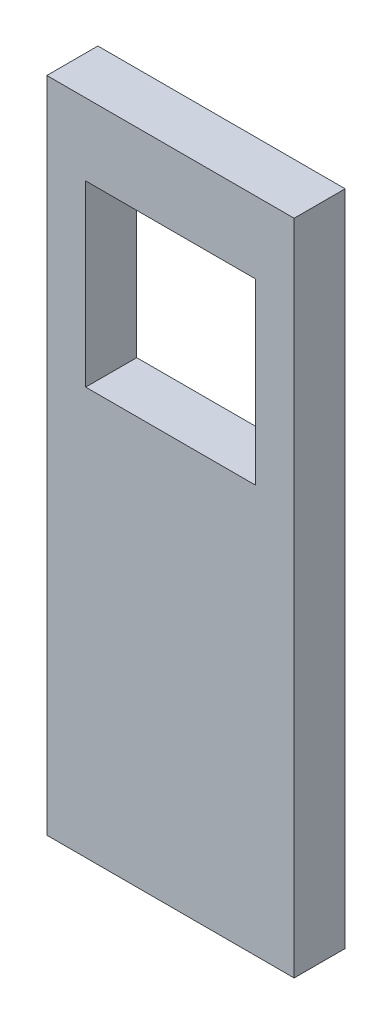
ISO-10303-21;
HEADER;
FILE_DESCRIPTION(('STEP AP214'),'2;1');
FILE_NAME('part.step','',(''),(''),'','','');
FILE_SCHEMA(('AUTOMOTIVE_DESIGN { 1 0 10303 214 1 1 1 1 }'));
ENDSEC;
DATA;
#1=APPLICATION_CONTEXT('core data for automotive mechanical design processes');
#2=APPLICATION_PROTOCOL_DEFINITION('international standard','automotive_design',2000,#1);
#3=PRODUCT_CONTEXT('',#1,'mechanical');
#4=PRODUCT('Part','Part','',(#3));
#5=PRODUCT_RELATED_PRODUCT_CATEGORY('part','',(#4));
#6=PRODUCT_DEFINITION_FORMATION('','',#4);
#7=PRODUCT_DEFINITION_CONTEXT('part definition',#1,'design');
#8=PRODUCT_DEFINITION('design','',#6,#7);
#9=PRODUCT_DEFINITION_SHAPE('','',#8);
#10=(LENGTH_UNIT() NAMED_UNIT(*) SI_UNIT(.MILLI.,.METRE.));
#11=(NAMED_UNIT(*) PLANE_ANGLE_UNIT() SI_UNIT($,.RADIAN.));
#12=(NAMED_UNIT(*) SI_UNIT($,.STERADIAN.) SOLID_ANGLE_UNIT());
#13=UNCERTAINTY_MEASURE_WITH_UNIT(LENGTH_MEASURE(1.E-05),#10,'distance_accuracy_value','');
#14=(GEOMETRIC_REPRESENTATION_CONTEXT(3) GLOBAL_UNCERTAINTY_ASSIGNED_CONTEXT((#13)) GLOBAL_UNIT_ASSIGNED_CONTEXT((#10,
#11,#12)) REPRESENTATION_CONTEXT('',''));
#15=CARTESIAN_POINT('',(0.,0.,0.));
#16=DIRECTION('',(0.,0.,1.));
#17=DIRECTION('',(1.,0.,0.));
#18=AXIS2_PLACEMENT_3D('',#15,#16,#17);
#19=CARTESIAN_POINT('',(0.,0.,2.6));
#20=DIRECTION('',(0.,0.,-1.));
#21=DIRECTION('',(-1.,0.,0.));
#22=AXIS2_PLACEMENT_3D('',#19,#20,#21);
#23=PLANE('',#22);
#24=DIRECTION('',(-1.,0.,0.));
#25=VECTOR('',#24,1.);
#26=CARTESIAN_POINT('',(-0.100000000000003,66.95,2.6));
#27=LINE('',#26,#25);
#28=CARTESIAN_POINT('',(25.1,66.95,2.6));
#29=VERTEX_POINT('',#28);
#30=CARTESIAN_POINT('',(-0.100000000000003,66.95,2.6));
#31=VERTEX_POINT('',#30);
#32=EDGE_CURVE('E134',#29,#31,#27,.T.);
#33=ORIENTED_EDGE('',*,*,#32,.T.);
#34=DIRECTION('',(0.,-1.,0.));
#35=VECTOR('',#34,1.);
#36=CARTESIAN_POINT('',(-0.100000000000003,66.95,2.6));
#37=LINE('',#36,#35);
#38=CARTESIAN_POINT('',(-0.0999999999999994,-0.0999999999999939,2.6));
#39=VERTEX_POINT('',#38);
#40=EDGE_CURVE('E137',#31,#39,#37,.T.);
#41=ORIENTED_EDGE('',*,*,#40,.T.);
#42=DIRECTION('',(1.,0.,0.));
#43=VECTOR('',#42,1.);
#44=CARTESIAN_POINT('',(25.1,-0.0999999999999925,2.6));
#45=LINE('',#44,#43);
#46=CARTESIAN_POINT('',(25.1,-0.0999999999999925,2.6));
#47=VERTEX_POINT('',#46);
#48=EDGE_CURVE('E140',#39,#47,#45,.T.);
#49=ORIENTED_EDGE('',*,*,#48,.T.);
#50=DIRECTION('',(0.,1.,0.));
#51=VECTOR('',#50,1.);
#52=CARTESIAN_POINT('',(25.1,22.3,2.6));
#53=LINE('',#52,#51);
#54=EDGE_CURVE('E142',#47,#29,#53,.T.);
#55=ORIENTED_EDGE('',*,*,#54,.T.);
#56=EDGE_LOOP('',(#33,#41,#49,#55));
#57=FACE_BOUND('',#56,.T.);
#58=DIRECTION('',(-1.,0.,0.));
#59=VECTOR('',#58,1.);
#60=CARTESIAN_POINT('',(3.86,59.625,2.6));
#61=LINE('',#60,#59);
#62=CARTESIAN_POINT('',(21.14,59.625,2.6));
#63=VERTEX_POINT('',#62);
#64=CARTESIAN_POINT('',(3.86,59.625,2.6));
#65=VERTEX_POINT('',#64);
#66=EDGE_CURVE('E98',#63,#65,#61,.T.);
#67=ORIENTED_EDGE('',*,*,#66,.F.);
#68=DIRECTION('',(0.,1.,0.));
#69=VECTOR('',#68,1.);
#70=CARTESIAN_POINT('',(21.14,59.625,2.6));
#71=LINE('',#70,#69);
#72=CARTESIAN_POINT('',(21.14,41.425,2.6));
#73=VERTEX_POINT('',#72);
#74=EDGE_CURVE('E120',#73,#63,#71,.T.);
#75=ORIENTED_EDGE('',*,*,#74,.F.);
#76=DIRECTION('',(1.,0.,0.));
#77=VECTOR('',#76,1.);
#78=CARTESIAN_POINT('',(3.86,41.425,2.6));
#79=LINE('',#78,#77);
#80=CARTESIAN_POINT('',(3.86,41.425,2.6));
#81=VERTEX_POINT('',#80);
#82=EDGE_CURVE('E118',#81,#73,#79,.T.);
#83=ORIENTED_EDGE('',*,*,#82,.F.);
#84=DIRECTION('',(0.,-1.,0.));
#85=VECTOR('',#84,1.);
#86=CARTESIAN_POINT('',(3.86,59.625,2.6));
#87=LINE('',#86,#85);
#88=EDGE_CURVE('E106',#65,#81,#87,.T.);
#89=ORIENTED_EDGE('',*,*,#88,.F.);
#90=EDGE_LOOP('',(#67,#75,#83,#89));
#91=FACE_BOUND('',#90,.T.);
#92=ADVANCED_FACE('F33',(#57,#91),#23,.F.);
#93=CARTESIAN_POINT('',(0.,0.,-2.6));
#94=DIRECTION('',(0.,0.,-1.));
#95=DIRECTION('',(-1.,0.,0.));
#96=AXIS2_PLACEMENT_3D('',#93,#94,#95);
#97=PLANE('',#96);
#98=DIRECTION('',(-1.,0.,0.));
#99=VECTOR('',#98,1.);
#100=CARTESIAN_POINT('',(-0.100000000000003,66.95,-2.6));
#101=LINE('',#100,#99);
#102=CARTESIAN_POINT('',(25.1,66.95,-2.6));
#103=VERTEX_POINT('',#102);
#104=CARTESIAN_POINT('',(-0.100000000000003,66.95,-2.6));
#105=VERTEX_POINT('',#104);
#106=EDGE_CURVE('E114',#103,#105,#101,.T.);
#107=ORIENTED_EDGE('',*,*,#106,.F.);
#108=DIRECTION('',(0.,1.,0.));
#109=VECTOR('',#108,1.);
#110=CARTESIAN_POINT('',(25.1,66.95,-2.6));
#111=LINE('',#110,#109);
#112=CARTESIAN_POINT('',(25.1,-0.0999999999999925,-2.6));
#113=VERTEX_POINT('',#112);
#114=EDGE_CURVE('E138',#113,#103,#111,.T.);
#115=ORIENTED_EDGE('',*,*,#114,.F.);
#116=DIRECTION('',(1.,0.,0.));
#117=VECTOR('',#116,1.);
#118=CARTESIAN_POINT('',(25.1,-0.0999999999999925,-2.6));
#119=LINE('',#118,#117);
#120=CARTESIAN_POINT('',(-0.0999999999999994,-0.0999999999999939,-2.6));
#121=VERTEX_POINT('',#120);
#122=EDGE_CURVE('E149',#121,#113,#119,.T.);
#123=ORIENTED_EDGE('',*,*,#122,.F.);
#124=DIRECTION('',(0.,-1.,0.));
#125=VECTOR('',#124,1.);
#126=CARTESIAN_POINT('',(-0.0999999999999985,22.3,-2.6));
#127=LINE('',#126,#125);
#128=EDGE_CURVE('E147',#105,#121,#127,.T.);
#129=ORIENTED_EDGE('',*,*,#128,.F.);
#130=EDGE_LOOP('',(#107,#115,#123,#129));
#131=FACE_BOUND('',#130,.T.);
#132=DIRECTION('',(0.,1.,0.));
#133=VECTOR('',#132,1.);
#134=CARTESIAN_POINT('',(21.14,59.625,-2.6));
#135=LINE('',#134,#133);
#136=CARTESIAN_POINT('',(21.14,41.425,-2.6));
#137=VERTEX_POINT('',#136);
#138=CARTESIAN_POINT('',(21.14,59.625,-2.6));
#139=VERTEX_POINT('',#138);
#140=EDGE_CURVE('E107',#137,#139,#135,.T.);
#141=ORIENTED_EDGE('',*,*,#140,.T.);
#142=DIRECTION('',(-1.,0.,0.));
#143=VECTOR('',#142,1.);
#144=CARTESIAN_POINT('',(3.86,59.625,-2.6));
#145=LINE('',#144,#143);
#146=CARTESIAN_POINT('',(3.86,59.625,-2.6));
#147=VERTEX_POINT('',#146);
#148=EDGE_CURVE('E56',#139,#147,#145,.T.);
#149=ORIENTED_EDGE('',*,*,#148,.T.);
#150=DIRECTION('',(0.,-1.,0.));
#151=VECTOR('',#150,1.);
#152=CARTESIAN_POINT('',(3.86,59.625,-2.6));
#153=LINE('',#152,#151);
#154=CARTESIAN_POINT('',(3.86,41.425,-2.6));
#155=VERTEX_POINT('',#154);
#156=EDGE_CURVE('E113',#147,#155,#153,.T.);
#157=ORIENTED_EDGE('',*,*,#156,.T.);
#158=DIRECTION('',(1.,0.,0.));
#159=VECTOR('',#158,1.);
#160=CARTESIAN_POINT('',(3.86,41.425,-2.6));
#161=LINE('',#160,#159);
#162=EDGE_CURVE('E126',#155,#137,#161,.T.);
#163=ORIENTED_EDGE('',*,*,#162,.T.);
#164=EDGE_LOOP('',(#141,#149,#157,#163));
#165=FACE_BOUND('',#164,.T.);
#166=ADVANCED_FACE('F167',(#131,#165),#97,.T.);
#167=CARTESIAN_POINT('',(-0.100000000000003,66.95,2.6));
#168=DIRECTION('',(0.,-1.,0.));
#169=DIRECTION('',(0.,0.,-1.));
#170=AXIS2_PLACEMENT_3D('',#167,#168,#169);
#171=PLANE('',#170);
#172=ORIENTED_EDGE('',*,*,#106,.T.);
#173=DIRECTION('',(0.,0.,-1.));
#174=VECTOR('',#173,1.);
#175=CARTESIAN_POINT('',(-0.100000000000003,66.95,2.6));
#176=LINE('',#175,#174);
#177=EDGE_CURVE('E11',#31,#105,#176,.T.);
#178=ORIENTED_EDGE('',*,*,#177,.F.);
#179=ORIENTED_EDGE('',*,*,#32,.F.);
#180=DIRECTION('',(0.,0.,-1.));
#181=VECTOR('',#180,1.);
#182=CARTESIAN_POINT('',(25.1,66.95,2.6));
#183=LINE('',#182,#181);
#184=EDGE_CURVE('E144',#29,#103,#183,.T.);
#185=ORIENTED_EDGE('',*,*,#184,.T.);
#186=EDGE_LOOP('',(#172,#178,#179,#185));
#187=FACE_BOUND('',#186,.T.);
#188=ADVANCED_FACE('F35',(#187),#171,.F.);
#189=CARTESIAN_POINT('',(-0.0999999999999985,22.3,2.6));
#190=DIRECTION('',(1.,0.,0.));
#191=DIRECTION('',(0.,1.,0.));
#192=AXIS2_PLACEMENT_3D('',#189,#190,#191);
#193=PLANE('',#192);
#194=ORIENTED_EDGE('',*,*,#128,.T.);
#195=DIRECTION('',(0.,0.,-1.));
#196=VECTOR('',#195,1.);
#197=CARTESIAN_POINT('',(-0.0999999999999994,-0.0999999999999939,2.6));
#198=LINE('',#197,#196);
#199=EDGE_CURVE('E41',#39,#121,#198,.T.);
#200=ORIENTED_EDGE('',*,*,#199,.F.);
#201=ORIENTED_EDGE('',*,*,#40,.F.);
#202=ORIENTED_EDGE('',*,*,#177,.T.);
#203=EDGE_LOOP('',(#194,#200,#201,#202));
#204=FACE_BOUND('',#203,.T.);
#205=ADVANCED_FACE('F177',(#204),#193,.F.);
#206=CARTESIAN_POINT('',(25.1,-0.0999999999999925,2.6));
#207=DIRECTION('',(0.,1.,0.));
#208=DIRECTION('',(-1.,0.,0.));
#209=AXIS2_PLACEMENT_3D('',#206,#207,#208);
#210=PLANE('',#209);
#211=ORIENTED_EDGE('',*,*,#122,.T.);
#212=DIRECTION('',(0.,0.,-1.));
#213=VECTOR('',#212,1.);
#214=CARTESIAN_POINT('',(25.1,-0.0999999999999925,2.6));
#215=LINE('',#214,#213);
#216=EDGE_CURVE('E155',#47,#113,#215,.T.);
#217=ORIENTED_EDGE('',*,*,#216,.F.);
#218=ORIENTED_EDGE('',*,*,#48,.F.);
#219=ORIENTED_EDGE('',*,*,#199,.T.);
#220=EDGE_LOOP('',(#211,#217,#218,#219));
#221=FACE_BOUND('',#220,.T.);
#222=ADVANCED_FACE('F162',(#221),#210,.F.);
#223=CARTESIAN_POINT('',(25.1,66.95,2.6));
#224=DIRECTION('',(-1.,0.,0.));
#225=DIRECTION('',(0.,-1.,0.));
#226=AXIS2_PLACEMENT_3D('',#223,#224,#225);
#227=PLANE('',#226);
#228=ORIENTED_EDGE('',*,*,#114,.T.);
#229=ORIENTED_EDGE('',*,*,#184,.F.);
#230=ORIENTED_EDGE('',*,*,#54,.F.);
#231=ORIENTED_EDGE('',*,*,#216,.T.);
#232=EDGE_LOOP('',(#228,#229,#230,#231));
#233=FACE_BOUND('',#232,.T.);
#234=ADVANCED_FACE('F171',(#233),#227,.F.);
#235=CARTESIAN_POINT('',(3.86,59.625,2.6));
#236=DIRECTION('',(0.,-1.,0.));
#237=DIRECTION('',(0.,0.,-1.));
#238=AXIS2_PLACEMENT_3D('',#235,#236,#237);
#239=PLANE('',#238);
#240=ORIENTED_EDGE('',*,*,#148,.F.);
#241=DIRECTION('',(0.,0.,-1.));
#242=VECTOR('',#241,1.);
#243=CARTESIAN_POINT('',(21.14,59.625,2.6));
#244=LINE('',#243,#242);
#245=EDGE_CURVE('E102',#63,#139,#244,.T.);
#246=ORIENTED_EDGE('',*,*,#245,.F.);
#247=ORIENTED_EDGE('',*,*,#66,.T.);
#248=DIRECTION('',(0.,0.,-1.));
#249=VECTOR('',#248,1.);
#250=CARTESIAN_POINT('',(3.86,59.625,2.6));
#251=LINE('',#250,#249);
#252=EDGE_CURVE('E101',#65,#147,#251,.T.);
#253=ORIENTED_EDGE('',*,*,#252,.T.);
#254=EDGE_LOOP('',(#240,#246,#247,#253));
#255=FACE_BOUND('',#254,.T.);
#256=ADVANCED_FACE('F100',(#255),#239,.T.);
#257=CARTESIAN_POINT('',(3.86,59.625,2.6));
#258=DIRECTION('',(1.,0.,0.));
#259=DIRECTION('',(0.,0.,-1.));
#260=AXIS2_PLACEMENT_3D('',#257,#258,#259);
#261=PLANE('',#260);
#262=ORIENTED_EDGE('',*,*,#156,.F.);
#263=ORIENTED_EDGE('',*,*,#252,.F.);
#264=ORIENTED_EDGE('',*,*,#88,.T.);
#265=DIRECTION('',(0.,0.,-1.));
#266=VECTOR('',#265,1.);
#267=CARTESIAN_POINT('',(3.86,41.425,2.6));
#268=LINE('',#267,#266);
#269=EDGE_CURVE('E115',#81,#155,#268,.T.);
#270=ORIENTED_EDGE('',*,*,#269,.T.);
#271=EDGE_LOOP('',(#262,#263,#264,#270));
#272=FACE_BOUND('',#271,.T.);
#273=ADVANCED_FACE('F110',(#272),#261,.T.);
#274=CARTESIAN_POINT('',(3.86,41.425,2.6));
#275=DIRECTION('',(0.,1.,0.));
#276=DIRECTION('',(0.,0.,1.));
#277=AXIS2_PLACEMENT_3D('',#274,#275,#276);
#278=PLANE('',#277);
#279=ORIENTED_EDGE('',*,*,#162,.F.);
#280=ORIENTED_EDGE('',*,*,#269,.F.);
#281=ORIENTED_EDGE('',*,*,#82,.T.);
#282=DIRECTION('',(0.,0.,-1.));
#283=VECTOR('',#282,1.);
#284=CARTESIAN_POINT('',(21.14,41.425,2.6));
#285=LINE('',#284,#283);
#286=EDGE_CURVE('E48',#73,#137,#285,.T.);
#287=ORIENTED_EDGE('',*,*,#286,.T.);
#288=EDGE_LOOP('',(#279,#280,#281,#287));
#289=FACE_BOUND('',#288,.T.);
#290=ADVANCED_FACE('F200',(#289),#278,.T.);
#291=CARTESIAN_POINT('',(21.14,59.625,2.6));
#292=DIRECTION('',(-1.,0.,0.));
#293=DIRECTION('',(0.,0.,1.));
#294=AXIS2_PLACEMENT_3D('',#291,#292,#293);
#295=PLANE('',#294);
#296=ORIENTED_EDGE('',*,*,#140,.F.);
#297=ORIENTED_EDGE('',*,*,#286,.F.);
#298=ORIENTED_EDGE('',*,*,#74,.T.);
#299=ORIENTED_EDGE('',*,*,#245,.T.);
#300=EDGE_LOOP('',(#296,#297,#298,#299));
#301=FACE_BOUND('',#300,.T.);
#302=ADVANCED_FACE('F204',(#301),#295,.T.);
#303=CLOSED_SHELL('',(#92,#166,#188,#205,#222,#234,#256,#273,#290,#302));
#304=MANIFOLD_SOLID_BREP('B2',#303);
#305=ADVANCED_BREP_SHAPE_REPRESENTATION('',(#18,#304),#14);
#306=SHAPE_DEFINITION_REPRESENTATION(#9,#305);
ENDSEC;
END-ISO-10303-21;
